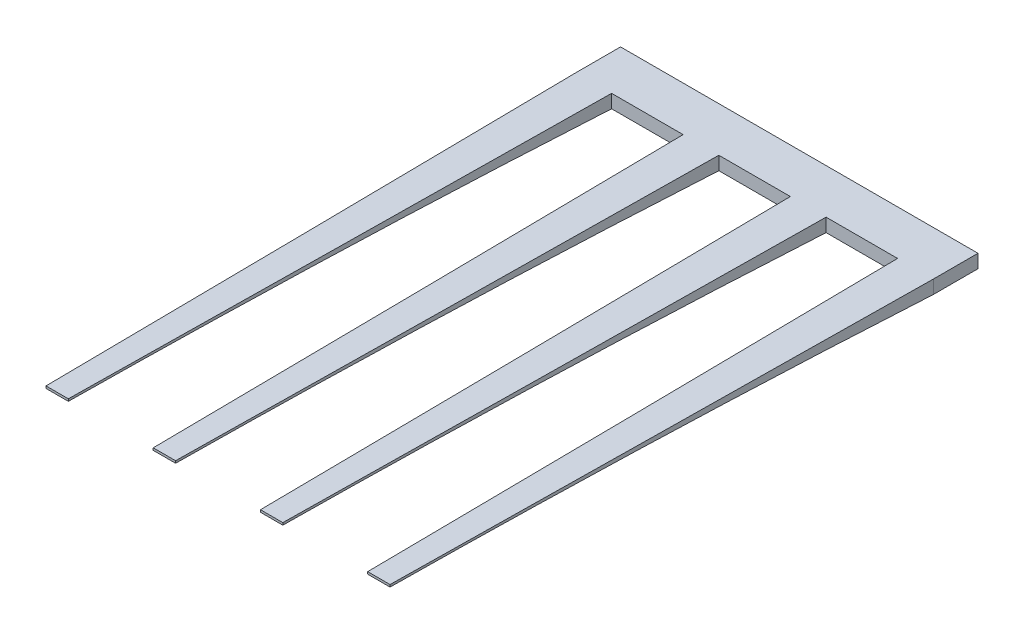
ISO-10303-21;
HEADER;
FILE_DESCRIPTION(('STEP AP214'),'2;1');
FILE_NAME('part.step','',(''),(''),'','','');
FILE_SCHEMA(('AUTOMOTIVE_DESIGN { 1 0 10303 214 1 1 1 1 }'));
ENDSEC;
DATA;
#1=APPLICATION_CONTEXT('core data for automotive mechanical design processes');
#2=APPLICATION_PROTOCOL_DEFINITION('international standard','automotive_design',2000,#1);
#3=PRODUCT_CONTEXT('',#1,'mechanical');
#4=PRODUCT('Part','Part','',(#3));
#5=PRODUCT_RELATED_PRODUCT_CATEGORY('part','',(#4));
#6=PRODUCT_DEFINITION_FORMATION('','',#4);
#7=PRODUCT_DEFINITION_CONTEXT('part definition',#1,'design');
#8=PRODUCT_DEFINITION('design','',#6,#7);
#9=PRODUCT_DEFINITION_SHAPE('','',#8);
#10=(LENGTH_UNIT() NAMED_UNIT(*) SI_UNIT(.MILLI.,.METRE.));
#11=(NAMED_UNIT(*) PLANE_ANGLE_UNIT() SI_UNIT($,.RADIAN.));
#12=(NAMED_UNIT(*) SI_UNIT($,.STERADIAN.) SOLID_ANGLE_UNIT());
#13=UNCERTAINTY_MEASURE_WITH_UNIT(LENGTH_MEASURE(1.E-05),#10,'distance_accuracy_value','');
#14=(GEOMETRIC_REPRESENTATION_CONTEXT(3) GLOBAL_UNCERTAINTY_ASSIGNED_CONTEXT((#13)) GLOBAL_UNIT_ASSIGNED_CONTEXT((#10,
#11,#12)) REPRESENTATION_CONTEXT('',''));
#15=CARTESIAN_POINT('',(0.,0.,0.));
#16=DIRECTION('',(0.,0.,1.));
#17=DIRECTION('',(1.,0.,0.));
#18=AXIS2_PLACEMENT_3D('',#15,#16,#17);
#19=CARTESIAN_POINT('',(0.,0.,200.));
#20=DIRECTION('',(0.,0.,1.));
#21=DIRECTION('',(1.,0.,0.));
#22=AXIS2_PLACEMENT_3D('',#19,#20,#21);
#23=PLANE('',#22);
#24=DIRECTION('',(0.,-1.,0.));
#25=VECTOR('',#24,1.);
#26=CARTESIAN_POINT('',(960.,0.,200.));
#27=LINE('',#26,#25);
#28=CARTESIAN_POINT('',(960.,0.,200.));
#29=VERTEX_POINT('',#28);
#30=CARTESIAN_POINT('',(960.,-60.,200.));
#31=VERTEX_POINT('',#30);
#32=EDGE_CURVE('E316',#29,#31,#27,.T.);
#33=ORIENTED_EDGE('',*,*,#32,.F.);
#34=DIRECTION('',(-1.,0.,0.));
#35=VECTOR('',#34,1.);
#36=CARTESIAN_POINT('',(0.,0.,200.));
#37=LINE('',#36,#35);
#38=CARTESIAN_POINT('',(640.,0.,200.));
#39=VERTEX_POINT('',#38);
#40=EDGE_CURVE('E206',#29,#39,#37,.T.);
#41=ORIENTED_EDGE('',*,*,#40,.T.);
#42=DIRECTION('',(0.,1.,0.));
#43=VECTOR('',#42,1.);
#44=CARTESIAN_POINT('',(640.,0.,200.));
#45=LINE('',#44,#43);
#46=CARTESIAN_POINT('',(640.,-60.,200.));
#47=VERTEX_POINT('',#46);
#48=EDGE_CURVE('E536',#47,#39,#45,.T.);
#49=ORIENTED_EDGE('',*,*,#48,.F.);
#50=DIRECTION('',(1.,0.,0.));
#51=VECTOR('',#50,1.);
#52=CARTESIAN_POINT('',(0.,-60.,200.));
#53=LINE('',#52,#51);
#54=EDGE_CURVE('E525',#47,#31,#53,.T.);
#55=ORIENTED_EDGE('',*,*,#54,.T.);
#56=EDGE_LOOP('',(#33,#41,#49,#55));
#57=FACE_BOUND('',#56,.T.);
#58=ADVANCED_FACE('F67',(#57),#23,.T.);
#59=DIRECTION('',(0.,-1.,0.));
#60=VECTOR('',#59,1.);
#61=CARTESIAN_POINT('',(480.,0.,200.));
#62=LINE('',#61,#60);
#63=CARTESIAN_POINT('',(480.,0.,200.));
#64=VERTEX_POINT('',#63);
#65=CARTESIAN_POINT('',(480.,-60.,200.));
#66=VERTEX_POINT('',#65);
#67=EDGE_CURVE('E704',#64,#66,#62,.T.);
#68=ORIENTED_EDGE('',*,*,#67,.F.);
#69=CARTESIAN_POINT('',(160.,0.,200.));
#70=VERTEX_POINT('',#69);
#71=EDGE_CURVE('E505',#64,#70,#37,.T.);
#72=ORIENTED_EDGE('',*,*,#71,.T.);
#73=DIRECTION('',(0.,1.,0.));
#74=VECTOR('',#73,1.);
#75=CARTESIAN_POINT('',(160.,0.,200.));
#76=LINE('',#75,#74);
#77=CARTESIAN_POINT('',(160.,-60.,200.));
#78=VERTEX_POINT('',#77);
#79=EDGE_CURVE('E766',#78,#70,#76,.T.);
#80=ORIENTED_EDGE('',*,*,#79,.F.);
#81=EDGE_CURVE('E522',#78,#66,#53,.T.);
#82=ORIENTED_EDGE('',*,*,#81,.T.);
#83=EDGE_LOOP('',(#68,#72,#80,#82));
#84=FACE_BOUND('',#83,.T.);
#85=ADVANCED_FACE('F929',(#84),#23,.T.);
#86=DIRECTION('',(0.,-1.,0.));
#87=VECTOR('',#86,1.);
#88=CARTESIAN_POINT('',(1440.,0.,200.));
#89=LINE('',#88,#87);
#90=CARTESIAN_POINT('',(1440.,0.,200.));
#91=VERTEX_POINT('',#90);
#92=CARTESIAN_POINT('',(1440.,-60.,200.));
#93=VERTEX_POINT('',#92);
#94=EDGE_CURVE('E209',#91,#93,#89,.T.);
#95=ORIENTED_EDGE('',*,*,#94,.F.);
#96=CARTESIAN_POINT('',(1120.,0.,200.));
#97=VERTEX_POINT('',#96);
#98=EDGE_CURVE('E197',#91,#97,#37,.T.);
#99=ORIENTED_EDGE('',*,*,#98,.T.);
#100=DIRECTION('',(0.,1.,0.));
#101=VECTOR('',#100,1.);
#102=CARTESIAN_POINT('',(1120.,0.,200.));
#103=LINE('',#102,#101);
#104=CARTESIAN_POINT('',(1120.,-60.,200.));
#105=VERTEX_POINT('',#104);
#106=EDGE_CURVE('E94',#105,#97,#103,.T.);
#107=ORIENTED_EDGE('',*,*,#106,.F.);
#108=EDGE_CURVE('E211',#105,#93,#53,.T.);
#109=ORIENTED_EDGE('',*,*,#108,.T.);
#110=EDGE_LOOP('',(#95,#99,#107,#109));
#111=FACE_BOUND('',#110,.T.);
#112=ADVANCED_FACE('F210',(#111),#23,.T.);
#113=CARTESIAN_POINT('',(0.,0.,200.));
#114=DIRECTION('',(1.,0.,0.));
#115=DIRECTION('',(0.,1.,0.));
#116=AXIS2_PLACEMENT_3D('',#113,#114,#115);
#117=PLANE('',#116);
#118=DIRECTION('',(0.,-1.,0.));
#119=VECTOR('',#118,1.);
#120=CARTESIAN_POINT('',(0.,0.,0.));
#121=LINE('',#120,#119);
#122=CARTESIAN_POINT('',(0.,0.,0.));
#123=VERTEX_POINT('',#122);
#124=CARTESIAN_POINT('',(0.,-60.,0.));
#125=VERTEX_POINT('',#124);
#126=EDGE_CURVE('E512',#123,#125,#121,.T.);
#127=ORIENTED_EDGE('',*,*,#126,.T.);
#128=DIRECTION('',(0.,0.,-1.));
#129=VECTOR('',#128,1.);
#130=CARTESIAN_POINT('',(0.,-60.,200.));
#131=LINE('',#130,#129);
#132=CARTESIAN_POINT('',(0.,-59.9999999999999,200.));
#133=VERTEX_POINT('',#132);
#134=EDGE_CURVE('E12',#133,#125,#131,.T.);
#135=ORIENTED_EDGE('',*,*,#134,.F.);
#136=DIRECTION('',(0.,1.,0.));
#137=VECTOR('',#136,1.);
#138=CARTESIAN_POINT('',(0.,0.,200.));
#139=LINE('',#138,#137);
#140=CARTESIAN_POINT('',(0.,0.,200.));
#141=VERTEX_POINT('',#140);
#142=EDGE_CURVE('E778',#141,#133,#139,.F.);
#143=ORIENTED_EDGE('',*,*,#142,.F.);
#144=DIRECTION('',(0.,0.,-1.));
#145=VECTOR('',#144,1.);
#146=CARTESIAN_POINT('',(0.,0.,200.));
#147=LINE('',#146,#145);
#148=EDGE_CURVE('E205',#141,#123,#147,.T.);
#149=ORIENTED_EDGE('',*,*,#148,.T.);
#150=EDGE_LOOP('',(#127,#135,#143,#149));
#151=FACE_BOUND('',#150,.T.);
#152=ADVANCED_FACE('F69',(#151),#117,.F.);
#153=CARTESIAN_POINT('',(0.,-60.,200.));
#154=DIRECTION('',(0.,1.,0.));
#155=DIRECTION('',(0.,0.,1.));
#156=AXIS2_PLACEMENT_3D('',#153,#154,#155);
#157=PLANE('',#156);
#158=DIRECTION('',(1.,0.,0.));
#159=VECTOR('',#158,1.);
#160=CARTESIAN_POINT('',(0.,-60.,0.));
#161=LINE('',#160,#159);
#162=CARTESIAN_POINT('',(1600.,-60.,0.));
#163=VERTEX_POINT('',#162);
#164=EDGE_CURVE('E790',#125,#163,#161,.T.);
#165=ORIENTED_EDGE('',*,*,#164,.T.);
#166=DIRECTION('',(0.,0.,-1.));
#167=VECTOR('',#166,1.);
#168=CARTESIAN_POINT('',(1600.,-60.,200.));
#169=LINE('',#168,#167);
#170=CARTESIAN_POINT('',(1600.,-60.,200.));
#171=VERTEX_POINT('',#170);
#172=EDGE_CURVE('E78',#171,#163,#169,.T.);
#173=ORIENTED_EDGE('',*,*,#172,.F.);
#174=DIRECTION('',(1.,0.,0.));
#175=VECTOR('',#174,1.);
#176=CARTESIAN_POINT('',(1440.,-60.,200.));
#177=LINE('',#176,#175);
#178=EDGE_CURVE('E86',#93,#171,#177,.T.);
#179=ORIENTED_EDGE('',*,*,#178,.F.);
#180=ORIENTED_EDGE('',*,*,#108,.F.);
#181=DIRECTION('',(1.,0.,0.));
#182=VECTOR('',#181,1.);
#183=CARTESIAN_POINT('',(960.,-60.,200.));
#184=LINE('',#183,#182);
#185=EDGE_CURVE('E405',#31,#105,#184,.T.);
#186=ORIENTED_EDGE('',*,*,#185,.F.);
#187=ORIENTED_EDGE('',*,*,#54,.F.);
#188=DIRECTION('',(1.,0.,0.));
#189=VECTOR('',#188,1.);
#190=CARTESIAN_POINT('',(480.,-60.,200.));
#191=LINE('',#190,#189);
#192=EDGE_CURVE('E532',#66,#47,#191,.T.);
#193=ORIENTED_EDGE('',*,*,#192,.F.);
#194=ORIENTED_EDGE('',*,*,#81,.F.);
#195=DIRECTION('',(1.,0.,0.));
#196=VECTOR('',#195,1.);
#197=CARTESIAN_POINT('',(0.,-60.,200.));
#198=LINE('',#197,#196);
#199=EDGE_CURVE('E520',#133,#78,#198,.T.);
#200=ORIENTED_EDGE('',*,*,#199,.F.);
#201=ORIENTED_EDGE('',*,*,#134,.T.);
#202=EDGE_LOOP('',(#165,#173,#179,#180,#186,#187,#193,#194,#200,#201));
#203=FACE_BOUND('',#202,.T.);
#204=ADVANCED_FACE('F538',(#203),#157,.F.);
#205=CARTESIAN_POINT('',(1600.,0.,200.));
#206=DIRECTION('',(-1.,0.,0.));
#207=DIRECTION('',(0.,0.,1.));
#208=AXIS2_PLACEMENT_3D('',#205,#206,#207);
#209=PLANE('',#208);
#210=DIRECTION('',(0.,1.,0.));
#211=VECTOR('',#210,1.);
#212=CARTESIAN_POINT('',(1600.,0.,0.));
#213=LINE('',#212,#211);
#214=CARTESIAN_POINT('',(1600.,0.,0.));
#215=VERTEX_POINT('',#214);
#216=EDGE_CURVE('E785',#163,#215,#213,.T.);
#217=ORIENTED_EDGE('',*,*,#216,.T.);
#218=DIRECTION('',(0.,0.,-1.));
#219=VECTOR('',#218,1.);
#220=CARTESIAN_POINT('',(1600.,0.,200.));
#221=LINE('',#220,#219);
#222=CARTESIAN_POINT('',(1600.,0.,200.));
#223=VERTEX_POINT('',#222);
#224=EDGE_CURVE('E793',#223,#215,#221,.T.);
#225=ORIENTED_EDGE('',*,*,#224,.F.);
#226=CARTESIAN_POINT('',(1600.,-60.,200.));
#227=CARTESIAN_POINT('',(1600.,-40.,200.));
#228=CARTESIAN_POINT('',(1600.,-20.,200.));
#229=CARTESIAN_POINT('',(1600.,0.,200.));
#230=B_SPLINE_CURVE_WITH_KNOTS('',3,(#226,#227,#228,#229),.UNSPECIFIED.,.F.,.F.,(4,4),(0.,1.),.UNSPECIFIED.);
#231=EDGE_CURVE('E519',#171,#223,#230,.T.);
#232=ORIENTED_EDGE('',*,*,#231,.F.);
#233=ORIENTED_EDGE('',*,*,#172,.T.);
#234=EDGE_LOOP('',(#217,#225,#232,#233));
#235=FACE_BOUND('',#234,.T.);
#236=ADVANCED_FACE('F481',(#235),#209,.F.);
#237=CARTESIAN_POINT('',(0.,0.,200.));
#238=DIRECTION('',(0.,-1.,0.));
#239=DIRECTION('',(0.,0.,-1.));
#240=AXIS2_PLACEMENT_3D('',#237,#238,#239);
#241=PLANE('',#240);
#242=DIRECTION('',(-1.,0.,0.));
#243=VECTOR('',#242,1.);
#244=CARTESIAN_POINT('',(0.,0.,0.));
#245=LINE('',#244,#243);
#246=EDGE_CURVE('E780',#215,#123,#245,.T.);
#247=ORIENTED_EDGE('',*,*,#246,.T.);
#248=ORIENTED_EDGE('',*,*,#148,.F.);
#249=CARTESIAN_POINT('',(0.,0.,200.));
#250=CARTESIAN_POINT('',(5.29543733476208,0.,599.996525271547));
#251=CARTESIAN_POINT('',(15.2933864413457,0.,1399.82214827049));
#252=CARTESIAN_POINT('',(24.1135245263562,0.,2199.99652527155));
#253=CARTESIAN_POINT('',(28.2271307873913,0.,2600.));
#254=B_SPLINE_CURVE_WITH_KNOTS('',3,(#249,#250,#251,#252,#253),.UNSPECIFIED.,.F.,.F.,(4,1,4),
(0.,0.500056664517414,1.),.UNSPECIFIED.);
#255=CARTESIAN_POINT('',(28.2271307873913,0.,2600.));
#256=VERTEX_POINT('',#255);
#257=EDGE_CURVE('E768',#256,#141,#254,.F.);
#258=ORIENTED_EDGE('',*,*,#257,.F.);
#259=DIRECTION('',(-1.,0.,0.));
#260=VECTOR('',#259,1.);
#261=CARTESIAN_POINT('',(28.2271307873913,0.,2600.));
#262=LINE('',#261,#260);
#263=CARTESIAN_POINT('',(128.227130787391,0.,2600.));
#264=VERTEX_POINT('',#263);
#265=EDGE_CURVE('E796',#264,#256,#262,.T.);
#266=ORIENTED_EDGE('',*,*,#265,.F.);
#267=CARTESIAN_POINT('',(160.,0.,200.));
#268=CARTESIAN_POINT('',(155.295426424763,0.,600.003911060482));
#269=CARTESIAN_POINT('',(145.297930512797,0.,1399.81476248136));
#270=CARTESIAN_POINT('',(134.113513616357,0.,2200.00391106048));
#271=CARTESIAN_POINT('',(128.227130787391,0.,2600.));
#272=B_SPLINE_CURVE_WITH_KNOTS('',3,(#267,#268,#269,#270,#271),.UNSPECIFIED.,.F.,.F.,(4,1,4),
(0.,0.500056664517414,1.),.UNSPECIFIED.);
#273=EDGE_CURVE('E798',#70,#264,#272,.T.);
#274=ORIENTED_EDGE('',*,*,#273,.F.);
#275=ORIENTED_EDGE('',*,*,#71,.F.);
#276=CARTESIAN_POINT('',(480.,0.,200.));
#277=CARTESIAN_POINT('',(485.295437334762,0.,599.996525271547));
#278=CARTESIAN_POINT('',(495.293386441346,0.,1399.82214827049));
#279=CARTESIAN_POINT('',(504.113524526356,0.,2199.99652527155));
#280=CARTESIAN_POINT('',(508.227130787391,0.,2600.));
#281=B_SPLINE_CURVE_WITH_KNOTS('',3,(#276,#277,#278,#279,#280),.UNSPECIFIED.,.F.,.F.,(4,1,4),
(0.,0.500056664517414,1.),.UNSPECIFIED.);
#282=CARTESIAN_POINT('',(508.227130787391,0.,2600.));
#283=VERTEX_POINT('',#282);
#284=EDGE_CURVE('E623',#283,#64,#281,.F.);
#285=ORIENTED_EDGE('',*,*,#284,.F.);
#286=DIRECTION('',(-1.,0.,0.));
#287=VECTOR('',#286,1.);
#288=CARTESIAN_POINT('',(508.227130787391,0.,2600.));
#289=LINE('',#288,#287);
#290=CARTESIAN_POINT('',(608.227130787391,0.,2600.));
#291=VERTEX_POINT('',#290);
#292=EDGE_CURVE('E765',#291,#283,#289,.T.);
#293=ORIENTED_EDGE('',*,*,#292,.F.);
#294=CARTESIAN_POINT('',(640.,0.,200.));
#295=CARTESIAN_POINT('',(635.295426424763,0.,600.003911060482));
#296=CARTESIAN_POINT('',(625.297930512797,0.,1399.81476248136));
#297=CARTESIAN_POINT('',(614.113513616357,0.,2200.00391106048));
#298=CARTESIAN_POINT('',(608.227130787391,0.,2600.));
#299=B_SPLINE_CURVE_WITH_KNOTS('',3,(#294,#295,#296,#297,#298),.UNSPECIFIED.,.F.,.F.,(4,1,4),
(0.,0.500056664517414,1.),.UNSPECIFIED.);
#300=EDGE_CURVE('E610',#39,#291,#299,.T.);
#301=ORIENTED_EDGE('',*,*,#300,.F.);
#302=ORIENTED_EDGE('',*,*,#40,.F.);
#303=CARTESIAN_POINT('',(960.,0.,200.));
#304=CARTESIAN_POINT('',(965.295437334762,0.,599.996525271547));
#305=CARTESIAN_POINT('',(975.293386441346,0.,1399.82214827049));
#306=CARTESIAN_POINT('',(984.113524526356,0.,2199.99652527155));
#307=CARTESIAN_POINT('',(988.227130787391,0.,2600.));
#308=B_SPLINE_CURVE_WITH_KNOTS('',3,(#303,#304,#305,#306,#307),.UNSPECIFIED.,.F.,.F.,(4,1,4),
(0.,0.500056664517414,1.),.UNSPECIFIED.);
#309=CARTESIAN_POINT('',(988.227130787391,0.,2600.));
#310=VERTEX_POINT('',#309);
#311=EDGE_CURVE('E377',#310,#29,#308,.F.);
#312=ORIENTED_EDGE('',*,*,#311,.F.);
#313=DIRECTION('',(-1.,0.,0.));
#314=VECTOR('',#313,1.);
#315=CARTESIAN_POINT('',(988.227130787391,0.,2600.));
#316=LINE('',#315,#314);
#317=CARTESIAN_POINT('',(1088.22713078739,0.,2600.));
#318=VERTEX_POINT('',#317);
#319=EDGE_CURVE('E466',#318,#310,#316,.T.);
#320=ORIENTED_EDGE('',*,*,#319,.F.);
#321=CARTESIAN_POINT('',(1120.,0.,200.));
#322=CARTESIAN_POINT('',(1115.29542642476,0.,600.003911060482));
#323=CARTESIAN_POINT('',(1105.2979305128,0.,1399.81476248136));
#324=CARTESIAN_POINT('',(1094.11351361636,0.,2200.00391106048));
#325=CARTESIAN_POINT('',(1088.22713078739,0.,2600.));
#326=B_SPLINE_CURVE_WITH_KNOTS('',3,(#321,#322,#323,#324,#325),.UNSPECIFIED.,.F.,.F.,(4,1,4),
(0.,0.500056664517414,1.),.UNSPECIFIED.);
#327=EDGE_CURVE('E204',#97,#318,#326,.T.);
#328=ORIENTED_EDGE('',*,*,#327,.F.);
#329=ORIENTED_EDGE('',*,*,#98,.F.);
#330=CARTESIAN_POINT('',(1440.,0.,200.));
#331=CARTESIAN_POINT('',(1445.29543733476,0.,599.996525271547));
#332=CARTESIAN_POINT('',(1455.29338644135,0.,1399.82214827049));
#333=CARTESIAN_POINT('',(1464.11352452636,0.,2199.99652527155));
#334=CARTESIAN_POINT('',(1468.22713078739,0.,2600.));
#335=B_SPLINE_CURVE_WITH_KNOTS('',3,(#330,#331,#332,#333,#334),.UNSPECIFIED.,.F.,.F.,(4,1,4),
(0.,0.500056664517414,1.),.UNSPECIFIED.);
#336=CARTESIAN_POINT('',(1468.22713078739,0.,2600.));
#337=VERTEX_POINT('',#336);
#338=EDGE_CURVE('E202',#337,#91,#335,.F.);
#339=ORIENTED_EDGE('',*,*,#338,.F.);
#340=DIRECTION('',(-1.,0.,0.));
#341=VECTOR('',#340,1.);
#342=CARTESIAN_POINT('',(1468.22713078739,0.,2600.));
#343=LINE('',#342,#341);
#344=CARTESIAN_POINT('',(1568.22713078739,0.,2600.));
#345=VERTEX_POINT('',#344);
#346=EDGE_CURVE('E311',#345,#337,#343,.T.);
#347=ORIENTED_EDGE('',*,*,#346,.F.);
#348=CARTESIAN_POINT('',(1600.,0.,200.));
#349=CARTESIAN_POINT('',(1595.29542642476,0.,600.003911060482));
#350=CARTESIAN_POINT('',(1585.2979305128,0.,1399.81476248136));
#351=CARTESIAN_POINT('',(1574.11351361636,0.,2200.00391106048));
#352=CARTESIAN_POINT('',(1568.22713078739,0.,2600.));
#353=B_SPLINE_CURVE_WITH_KNOTS('',3,(#348,#349,#350,#351,#352),.UNSPECIFIED.,.F.,.F.,(4,1,4),
(0.,0.500056664517414,1.),.UNSPECIFIED.);
#354=EDGE_CURVE('E313',#223,#345,#353,.T.);
#355=ORIENTED_EDGE('',*,*,#354,.F.);
#356=ORIENTED_EDGE('',*,*,#224,.T.);
#357=EDGE_LOOP('',(#247,#248,#258,#266,#274,#275,#285,#293,#301,#302,#312,#320,#328,#329,#339,
#347,#355,#356));
#358=FACE_BOUND('',#357,.T.);
#359=ADVANCED_FACE('F199',(#358),#241,.F.);
#360=CARTESIAN_POINT('',(0.,0.,0.));
#361=DIRECTION('',(0.,0.,1.));
#362=DIRECTION('',(1.,0.,0.));
#363=AXIS2_PLACEMENT_3D('',#360,#361,#362);
#364=PLANE('',#363);
#365=ORIENTED_EDGE('',*,*,#126,.F.);
#366=ORIENTED_EDGE('',*,*,#246,.F.);
#367=ORIENTED_EDGE('',*,*,#216,.F.);
#368=ORIENTED_EDGE('',*,*,#164,.F.);
#369=EDGE_LOOP('',(#365,#366,#367,#368));
#370=FACE_BOUND('',#369,.T.);
#371=ADVANCED_FACE('F480',(#370),#364,.F.);
#372=CARTESIAN_POINT('',(0.,0.,2600.));
#373=DIRECTION('',(0.,0.,1.));
#374=DIRECTION('',(1.,0.,0.));
#375=AXIS2_PLACEMENT_3D('',#372,#373,#374);
#376=PLANE('',#375);
#377=DIRECTION('',(0.,-1.,0.));
#378=VECTOR('',#377,1.);
#379=CARTESIAN_POINT('',(28.2271307873913,0.,2600.));
#380=LINE('',#379,#378);
#381=CARTESIAN_POINT('',(28.2271307873913,-10.,2600.));
#382=VERTEX_POINT('',#381);
#383=EDGE_CURVE('E849',#256,#382,#380,.T.);
#384=ORIENTED_EDGE('',*,*,#383,.T.);
#385=DIRECTION('',(1.,0.,0.));
#386=VECTOR('',#385,1.);
#387=CARTESIAN_POINT('',(28.2271307873913,-10.,2600.));
#388=LINE('',#387,#386);
#389=CARTESIAN_POINT('',(128.227130787391,-10.,2600.));
#390=VERTEX_POINT('',#389);
#391=EDGE_CURVE('E808',#382,#390,#388,.T.);
#392=ORIENTED_EDGE('',*,*,#391,.T.);
#393=DIRECTION('',(0.,1.,0.));
#394=VECTOR('',#393,1.);
#395=CARTESIAN_POINT('',(128.227130787391,0.,2600.));
#396=LINE('',#395,#394);
#397=EDGE_CURVE('E803',#390,#264,#396,.T.);
#398=ORIENTED_EDGE('',*,*,#397,.T.);
#399=ORIENTED_EDGE('',*,*,#265,.T.);
#400=EDGE_LOOP('',(#384,#392,#398,#399));
#401=FACE_BOUND('',#400,.T.);
#402=ADVANCED_FACE('F807',(#401),#376,.T.);
#403=CARTESIAN_POINT('',(0.,0.,200.));
#404=CARTESIAN_POINT('',(5.29543733476208,0.,599.996525271547));
#405=CARTESIAN_POINT('',(15.2933864413457,0.,1399.82214827049));
#406=CARTESIAN_POINT('',(24.1135245263562,0.,2199.99652527155));
#407=CARTESIAN_POINT('',(28.2271307873913,0.,2600.));
#408=CARTESIAN_POINT('',(0.,-20.,200.));
#409=CARTESIAN_POINT('',(5.29502919564721,-13.8896359743162,599.961823413853));
#410=CARTESIAN_POINT('',(15.293794580471,-5.00051208325618,1399.85685012907));
#411=CARTESIAN_POINT('',(24.1131163872414,-2.77852486320511,2199.96182341385));
#412=CARTESIAN_POINT('',(28.2271307873913,-3.33333333333333,2600.));
#413=CARTESIAN_POINT('',(0.,-40.,200.));
#414=CARTESIAN_POINT('',(5.29462105653233,-27.7792719486324,599.927121556159));
#415=CARTESIAN_POINT('',(15.2942027195964,-10.0010241665124,1399.89155198766));
#416=CARTESIAN_POINT('',(24.1127082481265,-5.55704972641022,2199.92712155616));
#417=CARTESIAN_POINT('',(28.2271307873913,-6.66666666666667,2600.));
#418=CARTESIAN_POINT('',(0.,-60.,200.));
#419=CARTESIAN_POINT('',(5.29421291741746,-41.6689079229487,599.892419698464));
#420=CARTESIAN_POINT('',(15.2946108587217,-15.0015362497685,1399.92625384624));
#421=CARTESIAN_POINT('',(24.1123001090116,-8.33557458961532,2199.89241969846));
#422=CARTESIAN_POINT('',(28.2271307873913,-10.,2600.));
#423=B_SPLINE_SURFACE_WITH_KNOTS('',3,3,((#403,#404,#405,#406,#407),(#408,#409,#410,#411,#412),
(#413,#414,#415,#416,#417),(#418,#419,#420,#421,#422)),.UNSPECIFIED.,.F.,.F.,.F.,(4,4),(4,1,4),
(0.,1.),(0.,0.500056664517414,1.),.UNSPECIFIED.);
#424=CARTESIAN_POINT('',(0.,-60.,200.));
#425=CARTESIAN_POINT('',(5.29421291741746,-41.6689079229487,599.892419698464));
#426=CARTESIAN_POINT('',(15.2946108587217,-15.0015362497685,1399.92625384624));
#427=CARTESIAN_POINT('',(24.1123001090116,-8.33557458961532,2199.89241969846));
#428=CARTESIAN_POINT('',(28.2271307873913,-10.,2600.));
#429=B_SPLINE_CURVE_WITH_KNOTS('',3,(#424,#425,#426,#427,#428),.UNSPECIFIED.,.F.,.F.,(4,1,4),
(0.,0.500056664517414,1.),.UNSPECIFIED.);
#430=EDGE_CURVE('E776',#133,#382,#429,.T.);
#431=ORIENTED_EDGE('',*,*,#142,.T.);
#432=ORIENTED_EDGE('',*,*,#430,.T.);
#433=ORIENTED_EDGE('',*,*,#383,.F.);
#434=ORIENTED_EDGE('',*,*,#257,.T.);
#435=EDGE_LOOP('',(#431,#432,#433,#434));
#436=FACE_BOUND('',#435,.T.);
#437=ADVANCED_FACE('F742',(#436),#423,.T.);
#438=CARTESIAN_POINT('',(0.,-60.,200.));
#439=CARTESIAN_POINT('',(5.29421291741746,-41.6689079229487,599.892419698464));
#440=CARTESIAN_POINT('',(15.2946108587217,-15.0015362497685,1399.92625384624));
#441=CARTESIAN_POINT('',(24.1123001090116,-8.33557458961532,2199.89241969846));
#442=CARTESIAN_POINT('',(28.2271307873913,-10.,2600.));
#443=CARTESIAN_POINT('',(53.3333333333333,-60.,200.));
#444=CARTESIAN_POINT('',(55.2950768243731,-41.6688566283096,599.894881841139));
#445=CARTESIAN_POINT('',(58.6285913388944,-15.0015875444089,1399.92379170351));
#446=CARTESIAN_POINT('',(60.7798306826339,-8.33552329497627,2199.89488184114));
#447=CARTESIAN_POINT('',(61.5604641207246,-10.,2600.));
#448=CARTESIAN_POINT('',(106.666666666667,-60.,200.));
#449=CARTESIAN_POINT('',(105.295940731329,-41.6688053336705,599.897343983814));
#450=CARTESIAN_POINT('',(101.962571819067,-15.0016388390493,1399.92132956077));
#451=CARTESIAN_POINT('',(97.4473612562562,-8.33547200033721,2199.89734398381));
#452=CARTESIAN_POINT('',(94.8937974540579,-10.,2600.));
#453=CARTESIAN_POINT('',(160.,-60.,200.));
#454=CARTESIAN_POINT('',(155.296804638284,-41.6687540390315,599.899806126488));
#455=CARTESIAN_POINT('',(145.29655229924,-15.0016901336897,1399.91886741803));
#456=CARTESIAN_POINT('',(134.114891829879,-8.33542070569816,2199.89980612649));
#457=CARTESIAN_POINT('',(128.227130787391,-10.,2600.));
#458=B_SPLINE_SURFACE_WITH_KNOTS('',3,3,((#438,#439,#440,#441,#442),(#443,#444,#445,#446,#447),
(#448,#449,#450,#451,#452),(#453,#454,#455,#456,#457)),.UNSPECIFIED.,.F.,.F.,.F.,(4,4),(4,1,4),
(0.,1.),(0.,0.500056664517414,1.),.UNSPECIFIED.);
#459=CARTESIAN_POINT('',(160.,-60.,200.));
#460=CARTESIAN_POINT('',(155.296804638284,-41.6687540390315,599.899806126488));
#461=CARTESIAN_POINT('',(145.29655229924,-15.0016901336897,1399.91886741803));
#462=CARTESIAN_POINT('',(134.114891829879,-8.33542070569816,2199.89980612649));
#463=CARTESIAN_POINT('',(128.227130787391,-10.,2600.));
#464=B_SPLINE_CURVE_WITH_KNOTS('',3,(#459,#460,#461,#462,#463),.UNSPECIFIED.,.F.,.F.,(4,1,4),
(0.,0.500056664517414,1.),.UNSPECIFIED.);
#465=EDGE_CURVE('E859',#78,#390,#464,.T.);
#466=ORIENTED_EDGE('',*,*,#199,.T.);
#467=ORIENTED_EDGE('',*,*,#465,.T.);
#468=ORIENTED_EDGE('',*,*,#391,.F.);
#469=ORIENTED_EDGE('',*,*,#430,.F.);
#470=EDGE_LOOP('',(#466,#467,#468,#469));
#471=FACE_BOUND('',#470,.T.);
#472=ADVANCED_FACE('F908',(#471),#458,.T.);
#473=CARTESIAN_POINT('',(160.,-60.,200.));
#474=CARTESIAN_POINT('',(155.296804638284,-41.6687540390315,599.899806126488));
#475=CARTESIAN_POINT('',(145.29655229924,-15.0016901336897,1399.91886741803));
#476=CARTESIAN_POINT('',(134.114891829879,-8.33542070569816,2199.89980612649));
#477=CARTESIAN_POINT('',(128.227130787391,-10.,2600.));
#478=CARTESIAN_POINT('',(160.,-40.,200.));
#479=CARTESIAN_POINT('',(155.296345233777,-27.7791693593543,599.934507771153));
#480=CARTESIAN_POINT('',(145.297011703759,-10.0011267557931,1399.88416577247));
#481=CARTESIAN_POINT('',(134.114432425371,-5.5569471371321,2199.93450777115));
#482=CARTESIAN_POINT('',(128.227130787391,-6.66666666666667,2600.));
#483=CARTESIAN_POINT('',(160.,-20.,200.));
#484=CARTESIAN_POINT('',(155.29588582927,-13.8895846796772,599.969209415817));
#485=CARTESIAN_POINT('',(145.297471108278,-5.00056337789655,1399.84946412692));
#486=CARTESIAN_POINT('',(134.113973020864,-2.77847356856605,2199.96920941582));
#487=CARTESIAN_POINT('',(128.227130787391,-3.33333333333333,2600.));
#488=CARTESIAN_POINT('',(160.,0.,200.));
#489=CARTESIAN_POINT('',(155.295426424763,0.,600.003911060482));
#490=CARTESIAN_POINT('',(145.297930512797,0.,1399.81476248136));
#491=CARTESIAN_POINT('',(134.113513616357,0.,2200.00391106048));
#492=CARTESIAN_POINT('',(128.227130787391,0.,2600.));
#493=B_SPLINE_SURFACE_WITH_KNOTS('',3,3,((#473,#474,#475,#476,#477),(#478,#479,#480,#481,#482),
(#483,#484,#485,#486,#487),(#488,#489,#490,#491,#492)),.UNSPECIFIED.,.F.,.F.,.F.,(4,4),(4,1,4),
(0.,1.),(0.,0.500056664517414,1.),.UNSPECIFIED.);
#494=ORIENTED_EDGE('',*,*,#79,.T.);
#495=ORIENTED_EDGE('',*,*,#273,.T.);
#496=ORIENTED_EDGE('',*,*,#397,.F.);
#497=ORIENTED_EDGE('',*,*,#465,.F.);
#498=EDGE_LOOP('',(#494,#495,#496,#497));
#499=FACE_BOUND('',#498,.T.);
#500=ADVANCED_FACE('F741',(#499),#493,.T.);
#501=CARTESIAN_POINT('',(480.,0.,2600.));
#502=DIRECTION('',(0.,0.,1.));
#503=DIRECTION('',(1.,0.,0.));
#504=AXIS2_PLACEMENT_3D('',#501,#502,#503);
#505=PLANE('',#504);
#506=DIRECTION('',(0.,-1.,0.));
#507=VECTOR('',#506,1.);
#508=CARTESIAN_POINT('',(508.227130787391,0.,2600.));
#509=LINE('',#508,#507);
#510=CARTESIAN_POINT('',(508.227130787391,-10.,2600.));
#511=VERTEX_POINT('',#510);
#512=EDGE_CURVE('E617',#283,#511,#509,.T.);
#513=ORIENTED_EDGE('',*,*,#512,.T.);
#514=DIRECTION('',(1.,0.,0.));
#515=VECTOR('',#514,1.);
#516=CARTESIAN_POINT('',(508.227130787391,-10.,2600.));
#517=LINE('',#516,#515);
#518=CARTESIAN_POINT('',(608.227130787391,-10.,2600.));
#519=VERTEX_POINT('',#518);
#520=EDGE_CURVE('E718',#511,#519,#517,.T.);
#521=ORIENTED_EDGE('',*,*,#520,.T.);
#522=DIRECTION('',(0.,1.,0.));
#523=VECTOR('',#522,1.);
#524=CARTESIAN_POINT('',(608.227130787391,0.,2600.));
#525=LINE('',#524,#523);
#526=EDGE_CURVE('E690',#519,#291,#525,.T.);
#527=ORIENTED_EDGE('',*,*,#526,.T.);
#528=ORIENTED_EDGE('',*,*,#292,.T.);
#529=EDGE_LOOP('',(#513,#521,#527,#528));
#530=FACE_BOUND('',#529,.T.);
#531=ADVANCED_FACE('F722',(#530),#505,.T.);
#532=CARTESIAN_POINT('',(480.,0.,200.));
#533=CARTESIAN_POINT('',(485.295437334762,0.,599.996525271547));
#534=CARTESIAN_POINT('',(495.293386441346,0.,1399.82214827049));
#535=CARTESIAN_POINT('',(504.113524526356,0.,2199.99652527155));
#536=CARTESIAN_POINT('',(508.227130787391,0.,2600.));
#537=CARTESIAN_POINT('',(480.,-20.,200.));
#538=CARTESIAN_POINT('',(485.295029195647,-13.8896359743162,599.961823413853));
#539=CARTESIAN_POINT('',(495.293794580471,-5.00051208325618,1399.85685012907));
#540=CARTESIAN_POINT('',(504.113116387241,-2.77852486320511,2199.96182341385));
#541=CARTESIAN_POINT('',(508.227130787391,-3.33333333333333,2600.));
#542=CARTESIAN_POINT('',(480.,-40.,200.));
#543=CARTESIAN_POINT('',(485.294621056532,-27.7792719486324,599.927121556159));
#544=CARTESIAN_POINT('',(495.294202719596,-10.0010241665124,1399.89155198766));
#545=CARTESIAN_POINT('',(504.112708248126,-5.55704972641022,2199.92712155616));
#546=CARTESIAN_POINT('',(508.227130787391,-6.66666666666667,2600.));
#547=CARTESIAN_POINT('',(480.,-60.,200.));
#548=CARTESIAN_POINT('',(485.294212917417,-41.6689079229487,599.892419698464));
#549=CARTESIAN_POINT('',(495.294610858722,-15.0015362497685,1399.92625384624));
#550=CARTESIAN_POINT('',(504.112300109012,-8.33557458961532,2199.89241969846));
#551=CARTESIAN_POINT('',(508.227130787391,-10.,2600.));
#552=B_SPLINE_SURFACE_WITH_KNOTS('',3,3,((#532,#533,#534,#535,#536),(#537,#538,#539,#540,#541),
(#542,#543,#544,#545,#546),(#547,#548,#549,#550,#551)),.UNSPECIFIED.,.F.,.F.,.F.,(4,4),(4,1,4),
(0.,1.),(0.,0.500056664517414,1.),.UNSPECIFIED.);
#553=CARTESIAN_POINT('',(480.,-60.,200.));
#554=CARTESIAN_POINT('',(485.294212917417,-41.6689079229487,599.892419698464));
#555=CARTESIAN_POINT('',(495.294610858722,-15.0015362497685,1399.92625384624));
#556=CARTESIAN_POINT('',(504.112300109012,-8.33557458961532,2199.89241969846));
#557=CARTESIAN_POINT('',(508.227130787391,-10.,2600.));
#558=B_SPLINE_CURVE_WITH_KNOTS('',3,(#553,#554,#555,#556,#557),.UNSPECIFIED.,.F.,.F.,(4,1,4),
(0.,0.500056664517414,1.),.UNSPECIFIED.);
#559=EDGE_CURVE('E629',#66,#511,#558,.T.);
#560=ORIENTED_EDGE('',*,*,#67,.T.);
#561=ORIENTED_EDGE('',*,*,#559,.T.);
#562=ORIENTED_EDGE('',*,*,#512,.F.);
#563=ORIENTED_EDGE('',*,*,#284,.T.);
#564=EDGE_LOOP('',(#560,#561,#562,#563));
#565=FACE_BOUND('',#564,.T.);
#566=ADVANCED_FACE('F595',(#565),#552,.T.);
#567=CARTESIAN_POINT('',(480.,-60.,200.));
#568=CARTESIAN_POINT('',(485.294212917417,-41.6689079229487,599.892419698464));
#569=CARTESIAN_POINT('',(495.294610858722,-15.0015362497685,1399.92625384624));
#570=CARTESIAN_POINT('',(504.112300109012,-8.33557458961532,2199.89241969846));
#571=CARTESIAN_POINT('',(508.227130787391,-10.,2600.));
#572=CARTESIAN_POINT('',(533.333333333333,-60.,200.));
#573=CARTESIAN_POINT('',(535.295076824373,-41.6688566283096,599.894881841139));
#574=CARTESIAN_POINT('',(538.628591338894,-15.0015875444089,1399.92379170351));
#575=CARTESIAN_POINT('',(540.779830682634,-8.33552329497627,2199.89488184114));
#576=CARTESIAN_POINT('',(541.560464120725,-10.,2600.));
#577=CARTESIAN_POINT('',(586.666666666667,-60.,200.));
#578=CARTESIAN_POINT('',(585.295940731329,-41.6688053336705,599.897343983814));
#579=CARTESIAN_POINT('',(581.962571819067,-15.0016388390493,1399.92132956077));
#580=CARTESIAN_POINT('',(577.447361256256,-8.33547200033721,2199.89734398381));
#581=CARTESIAN_POINT('',(574.893797454058,-10.,2600.));
#582=CARTESIAN_POINT('',(640.,-60.,200.));
#583=CARTESIAN_POINT('',(635.296804638284,-41.6687540390315,599.899806126488));
#584=CARTESIAN_POINT('',(625.29655229924,-15.0016901336897,1399.91886741803));
#585=CARTESIAN_POINT('',(614.114891829879,-8.33542070569816,2199.89980612649));
#586=CARTESIAN_POINT('',(608.227130787391,-10.,2600.));
#587=B_SPLINE_SURFACE_WITH_KNOTS('',3,3,((#567,#568,#569,#570,#571),(#572,#573,#574,#575,#576),
(#577,#578,#579,#580,#581),(#582,#583,#584,#585,#586)),.UNSPECIFIED.,.F.,.F.,.F.,(4,4),(4,1,4),
(0.,1.),(0.,0.500056664517414,1.),.UNSPECIFIED.);
#588=CARTESIAN_POINT('',(640.,-60.,200.));
#589=CARTESIAN_POINT('',(635.296804638284,-41.6687540390315,599.899806126488));
#590=CARTESIAN_POINT('',(625.29655229924,-15.0016901336897,1399.91886741803));
#591=CARTESIAN_POINT('',(614.114891829879,-8.33542070569816,2199.89980612649));
#592=CARTESIAN_POINT('',(608.227130787391,-10.,2600.));
#593=B_SPLINE_CURVE_WITH_KNOTS('',3,(#588,#589,#590,#591,#592),.UNSPECIFIED.,.F.,.F.,(4,1,4),
(0.,0.500056664517414,1.),.UNSPECIFIED.);
#594=EDGE_CURVE('E618',#47,#519,#593,.T.);
#595=ORIENTED_EDGE('',*,*,#192,.T.);
#596=ORIENTED_EDGE('',*,*,#594,.T.);
#597=ORIENTED_EDGE('',*,*,#520,.F.);
#598=ORIENTED_EDGE('',*,*,#559,.F.);
#599=EDGE_LOOP('',(#595,#596,#597,#598));
#600=FACE_BOUND('',#599,.T.);
#601=ADVANCED_FACE('F655',(#600),#587,.T.);
#602=CARTESIAN_POINT('',(640.,-60.,200.));
#603=CARTESIAN_POINT('',(635.296804638284,-41.6687540390315,599.899806126488));
#604=CARTESIAN_POINT('',(625.29655229924,-15.0016901336897,1399.91886741803));
#605=CARTESIAN_POINT('',(614.114891829879,-8.33542070569816,2199.89980612649));
#606=CARTESIAN_POINT('',(608.227130787391,-10.,2600.));
#607=CARTESIAN_POINT('',(640.,-40.,200.));
#608=CARTESIAN_POINT('',(635.296345233777,-27.7791693593543,599.934507771153));
#609=CARTESIAN_POINT('',(625.297011703759,-10.0011267557931,1399.88416577247));
#610=CARTESIAN_POINT('',(614.114432425371,-5.5569471371321,2199.93450777115));
#611=CARTESIAN_POINT('',(608.227130787391,-6.66666666666667,2600.));
#612=CARTESIAN_POINT('',(640.,-20.,200.));
#613=CARTESIAN_POINT('',(635.29588582927,-13.8895846796772,599.969209415817));
#614=CARTESIAN_POINT('',(625.297471108278,-5.00056337789655,1399.84946412692));
#615=CARTESIAN_POINT('',(614.113973020864,-2.77847356856605,2199.96920941582));
#616=CARTESIAN_POINT('',(608.227130787391,-3.33333333333333,2600.));
#617=CARTESIAN_POINT('',(640.,0.,200.));
#618=CARTESIAN_POINT('',(635.295426424763,0.,600.003911060482));
#619=CARTESIAN_POINT('',(625.297930512797,0.,1399.81476248136));
#620=CARTESIAN_POINT('',(614.113513616357,0.,2200.00391106048));
#621=CARTESIAN_POINT('',(608.227130787391,0.,2600.));
#622=B_SPLINE_SURFACE_WITH_KNOTS('',3,3,((#602,#603,#604,#605,#606),(#607,#608,#609,#610,#611),
(#612,#613,#614,#615,#616),(#617,#618,#619,#620,#621)),.UNSPECIFIED.,.F.,.F.,.F.,(4,4),(4,1,4),
(0.,1.),(0.,0.500056664517414,1.),.UNSPECIFIED.);
#623=ORIENTED_EDGE('',*,*,#48,.T.);
#624=ORIENTED_EDGE('',*,*,#300,.T.);
#625=ORIENTED_EDGE('',*,*,#526,.F.);
#626=ORIENTED_EDGE('',*,*,#594,.F.);
#627=EDGE_LOOP('',(#623,#624,#625,#626));
#628=FACE_BOUND('',#627,.T.);
#629=ADVANCED_FACE('F594',(#628),#622,.T.);
#630=CARTESIAN_POINT('',(960.,0.,2600.));
#631=DIRECTION('',(0.,0.,1.));
#632=DIRECTION('',(1.,0.,0.));
#633=AXIS2_PLACEMENT_3D('',#630,#631,#632);
#634=PLANE('',#633);
#635=DIRECTION('',(0.,-1.,0.));
#636=VECTOR('',#635,1.);
#637=CARTESIAN_POINT('',(988.227130787391,0.,2600.));
#638=LINE('',#637,#636);
#639=CARTESIAN_POINT('',(988.227130787391,-10.,2600.));
#640=VERTEX_POINT('',#639);
#641=EDGE_CURVE('E371',#310,#640,#638,.T.);
#642=ORIENTED_EDGE('',*,*,#641,.T.);
#643=DIRECTION('',(1.,0.,0.));
#644=VECTOR('',#643,1.);
#645=CARTESIAN_POINT('',(988.227130787391,-10.,2600.));
#646=LINE('',#645,#644);
#647=CARTESIAN_POINT('',(1088.22713078739,-10.,2600.));
#648=VERTEX_POINT('',#647);
#649=EDGE_CURVE('E567',#640,#648,#646,.T.);
#650=ORIENTED_EDGE('',*,*,#649,.T.);
#651=DIRECTION('',(0.,1.,0.));
#652=VECTOR('',#651,1.);
#653=CARTESIAN_POINT('',(1088.22713078739,0.,2600.));
#654=LINE('',#653,#652);
#655=EDGE_CURVE('E446',#648,#318,#654,.T.);
#656=ORIENTED_EDGE('',*,*,#655,.T.);
#657=ORIENTED_EDGE('',*,*,#319,.T.);
#658=EDGE_LOOP('',(#642,#650,#656,#657));
#659=FACE_BOUND('',#658,.T.);
#660=ADVANCED_FACE('F585',(#659),#634,.T.);
#661=CARTESIAN_POINT('',(960.,0.,200.));
#662=CARTESIAN_POINT('',(965.295437334762,0.,599.996525271547));
#663=CARTESIAN_POINT('',(975.293386441346,0.,1399.82214827049));
#664=CARTESIAN_POINT('',(984.113524526356,0.,2199.99652527155));
#665=CARTESIAN_POINT('',(988.227130787391,0.,2600.));
#666=CARTESIAN_POINT('',(960.,-20.,200.));
#667=CARTESIAN_POINT('',(965.295029195647,-13.8896359743162,599.961823413853));
#668=CARTESIAN_POINT('',(975.293794580471,-5.00051208325618,1399.85685012907));
#669=CARTESIAN_POINT('',(984.113116387241,-2.77852486320511,2199.96182341385));
#670=CARTESIAN_POINT('',(988.227130787391,-3.33333333333333,2600.));
#671=CARTESIAN_POINT('',(960.,-40.,200.));
#672=CARTESIAN_POINT('',(965.294621056532,-27.7792719486324,599.927121556159));
#673=CARTESIAN_POINT('',(975.294202719596,-10.0010241665124,1399.89155198766));
#674=CARTESIAN_POINT('',(984.112708248126,-5.55704972641022,2199.92712155616));
#675=CARTESIAN_POINT('',(988.227130787391,-6.66666666666667,2600.));
#676=CARTESIAN_POINT('',(960.,-60.,200.));
#677=CARTESIAN_POINT('',(965.294212917417,-41.6689079229487,599.892419698464));
#678=CARTESIAN_POINT('',(975.294610858722,-15.0015362497685,1399.92625384624));
#679=CARTESIAN_POINT('',(984.112300109012,-8.33557458961532,2199.89241969846));
#680=CARTESIAN_POINT('',(988.227130787391,-10.,2600.));
#681=B_SPLINE_SURFACE_WITH_KNOTS('',3,3,((#661,#662,#663,#664,#665),(#666,#667,#668,#669,#670),
(#671,#672,#673,#674,#675),(#676,#677,#678,#679,#680)),.UNSPECIFIED.,.F.,.F.,.F.,(4,4),(4,1,4),
(0.,1.),(0.,0.500056664517414,1.),.UNSPECIFIED.);
#682=CARTESIAN_POINT('',(960.,-60.,200.));
#683=CARTESIAN_POINT('',(965.294212917417,-41.6689079229487,599.892419698464));
#684=CARTESIAN_POINT('',(975.294610858722,-15.0015362497685,1399.92625384624));
#685=CARTESIAN_POINT('',(984.112300109012,-8.33557458961532,2199.89241969846));
#686=CARTESIAN_POINT('',(988.227130787391,-10.,2600.));
#687=B_SPLINE_CURVE_WITH_KNOTS('',3,(#682,#683,#684,#685,#686),.UNSPECIFIED.,.F.,.F.,(4,1,4),
(0.,0.500056664517414,1.),.UNSPECIFIED.);
#688=EDGE_CURVE('E383',#31,#640,#687,.T.);
#689=ORIENTED_EDGE('',*,*,#32,.T.);
#690=ORIENTED_EDGE('',*,*,#688,.T.);
#691=ORIENTED_EDGE('',*,*,#641,.F.);
#692=ORIENTED_EDGE('',*,*,#311,.T.);
#693=EDGE_LOOP('',(#689,#690,#691,#692));
#694=FACE_BOUND('',#693,.T.);
#695=ADVANCED_FACE('F338',(#694),#681,.T.);
#696=CARTESIAN_POINT('',(960.,-60.,200.));
#697=CARTESIAN_POINT('',(965.294212917417,-41.6689079229487,599.892419698464));
#698=CARTESIAN_POINT('',(975.294610858722,-15.0015362497685,1399.92625384624));
#699=CARTESIAN_POINT('',(984.112300109012,-8.33557458961532,2199.89241969846));
#700=CARTESIAN_POINT('',(988.227130787391,-10.,2600.));
#701=CARTESIAN_POINT('',(1013.33333333333,-60.,200.));
#702=CARTESIAN_POINT('',(1015.29507682437,-41.6688566283096,599.894881841139));
#703=CARTESIAN_POINT('',(1018.62859133889,-15.0015875444089,1399.92379170351));
#704=CARTESIAN_POINT('',(1020.77983068263,-8.33552329497627,2199.89488184114));
#705=CARTESIAN_POINT('',(1021.56046412072,-10.,2600.));
#706=CARTESIAN_POINT('',(1066.66666666667,-60.,200.));
#707=CARTESIAN_POINT('',(1065.29594073133,-41.6688053336705,599.897343983814));
#708=CARTESIAN_POINT('',(1061.96257181907,-15.0016388390493,1399.92132956077));
#709=CARTESIAN_POINT('',(1057.44736125626,-8.33547200033721,2199.89734398381));
#710=CARTESIAN_POINT('',(1054.89379745406,-10.,2600.));
#711=CARTESIAN_POINT('',(1120.,-60.,200.));
#712=CARTESIAN_POINT('',(1115.29680463828,-41.6687540390315,599.899806126488));
#713=CARTESIAN_POINT('',(1105.29655229924,-15.0016901336897,1399.91886741803));
#714=CARTESIAN_POINT('',(1094.11489182988,-8.33542070569816,2199.89980612649));
#715=CARTESIAN_POINT('',(1088.22713078739,-10.,2600.));
#716=B_SPLINE_SURFACE_WITH_KNOTS('',3,3,((#696,#697,#698,#699,#700),(#701,#702,#703,#704,#705),
(#706,#707,#708,#709,#710),(#711,#712,#713,#714,#715)),.UNSPECIFIED.,.F.,.F.,.F.,(4,4),(4,1,4),
(0.,1.),(0.,0.500056664517414,1.),.UNSPECIFIED.);
#717=CARTESIAN_POINT('',(1120.,-60.,200.));
#718=CARTESIAN_POINT('',(1115.29680463828,-41.6687540390315,599.899806126488));
#719=CARTESIAN_POINT('',(1105.29655229924,-15.0016901336897,1399.91886741803));
#720=CARTESIAN_POINT('',(1094.11489182988,-8.33542070569816,2199.89980612649));
#721=CARTESIAN_POINT('',(1088.22713078739,-10.,2600.));
#722=B_SPLINE_CURVE_WITH_KNOTS('',3,(#717,#718,#719,#720,#721),.UNSPECIFIED.,.F.,.F.,(4,1,4),
(0.,0.500056664517414,1.),.UNSPECIFIED.);
#723=EDGE_CURVE('E372',#105,#648,#722,.T.);
#724=ORIENTED_EDGE('',*,*,#185,.T.);
#725=ORIENTED_EDGE('',*,*,#723,.T.);
#726=ORIENTED_EDGE('',*,*,#649,.F.);
#727=ORIENTED_EDGE('',*,*,#688,.F.);
#728=EDGE_LOOP('',(#724,#725,#726,#727));
#729=FACE_BOUND('',#728,.T.);
#730=ADVANCED_FACE('F411',(#729),#716,.T.);
#731=CARTESIAN_POINT('',(1120.,-60.,200.));
#732=CARTESIAN_POINT('',(1115.29680463828,-41.6687540390315,599.899806126488));
#733=CARTESIAN_POINT('',(1105.29655229924,-15.0016901336897,1399.91886741803));
#734=CARTESIAN_POINT('',(1094.11489182988,-8.33542070569816,2199.89980612649));
#735=CARTESIAN_POINT('',(1088.22713078739,-10.,2600.));
#736=CARTESIAN_POINT('',(1120.,-40.,200.));
#737=CARTESIAN_POINT('',(1115.29634523378,-27.7791693593543,599.934507771153));
#738=CARTESIAN_POINT('',(1105.29701170376,-10.0011267557931,1399.88416577247));
#739=CARTESIAN_POINT('',(1094.11443242537,-5.5569471371321,2199.93450777115));
#740=CARTESIAN_POINT('',(1088.22713078739,-6.66666666666667,2600.));
#741=CARTESIAN_POINT('',(1120.,-20.,200.));
#742=CARTESIAN_POINT('',(1115.29588582927,-13.8895846796772,599.969209415817));
#743=CARTESIAN_POINT('',(1105.29747110828,-5.00056337789655,1399.84946412692));
#744=CARTESIAN_POINT('',(1094.11397302086,-2.77847356856605,2199.96920941582));
#745=CARTESIAN_POINT('',(1088.22713078739,-3.33333333333333,2600.));
#746=CARTESIAN_POINT('',(1120.,0.,200.));
#747=CARTESIAN_POINT('',(1115.29542642476,0.,600.003911060482));
#748=CARTESIAN_POINT('',(1105.2979305128,0.,1399.81476248136));
#749=CARTESIAN_POINT('',(1094.11351361636,0.,2200.00391106048));
#750=CARTESIAN_POINT('',(1088.22713078739,0.,2600.));
#751=B_SPLINE_SURFACE_WITH_KNOTS('',3,3,((#731,#732,#733,#734,#735),(#736,#737,#738,#739,#740),
(#741,#742,#743,#744,#745),(#746,#747,#748,#749,#750)),.UNSPECIFIED.,.F.,.F.,.F.,(4,4),(4,1,4),
(0.,1.),(0.,0.500056664517414,1.),.UNSPECIFIED.);
#752=ORIENTED_EDGE('',*,*,#106,.T.);
#753=ORIENTED_EDGE('',*,*,#327,.T.);
#754=ORIENTED_EDGE('',*,*,#655,.F.);
#755=ORIENTED_EDGE('',*,*,#723,.F.);
#756=EDGE_LOOP('',(#752,#753,#754,#755));
#757=FACE_BOUND('',#756,.T.);
#758=ADVANCED_FACE('F337',(#757),#751,.T.);
#759=CARTESIAN_POINT('',(1440.,0.,2600.));
#760=DIRECTION('',(0.,0.,1.));
#761=DIRECTION('',(1.,0.,0.));
#762=AXIS2_PLACEMENT_3D('',#759,#760,#761);
#763=PLANE('',#762);
#764=DIRECTION('',(0.,-1.,0.));
#765=VECTOR('',#764,1.);
#766=CARTESIAN_POINT('',(1468.22713078739,0.,2600.));
#767=LINE('',#766,#765);
#768=CARTESIAN_POINT('',(1468.22713078739,-10.,2600.));
#769=VERTEX_POINT('',#768);
#770=EDGE_CURVE('E219',#337,#769,#767,.T.);
#771=ORIENTED_EDGE('',*,*,#770,.T.);
#772=DIRECTION('',(1.,0.,0.));
#773=VECTOR('',#772,1.);
#774=CARTESIAN_POINT('',(1468.22713078739,-10.,2600.));
#775=LINE('',#774,#773);
#776=CARTESIAN_POINT('',(1568.22713078739,-10.,2600.));
#777=VERTEX_POINT('',#776);
#778=EDGE_CURVE('E321',#769,#777,#775,.T.);
#779=ORIENTED_EDGE('',*,*,#778,.T.);
#780=DIRECTION('',(0.,1.,0.));
#781=VECTOR('',#780,1.);
#782=CARTESIAN_POINT('',(1568.22713078739,0.,2600.));
#783=LINE('',#782,#781);
#784=EDGE_CURVE('E295',#777,#345,#783,.T.);
#785=ORIENTED_EDGE('',*,*,#784,.T.);
#786=ORIENTED_EDGE('',*,*,#346,.T.);
#787=EDGE_LOOP('',(#771,#779,#785,#786));
#788=FACE_BOUND('',#787,.T.);
#789=ADVANCED_FACE('F320',(#788),#763,.T.);
#790=CARTESIAN_POINT('',(1440.,0.,200.));
#791=CARTESIAN_POINT('',(1445.29543733476,0.,599.996525271547));
#792=CARTESIAN_POINT('',(1455.29338644135,0.,1399.82214827049));
#793=CARTESIAN_POINT('',(1464.11352452636,0.,2199.99652527155));
#794=CARTESIAN_POINT('',(1468.22713078739,0.,2600.));
#795=CARTESIAN_POINT('',(1440.,-20.,200.));
#796=CARTESIAN_POINT('',(1445.29502919565,-13.8896359743162,599.961823413853));
#797=CARTESIAN_POINT('',(1455.29379458047,-5.00051208325618,1399.85685012907));
#798=CARTESIAN_POINT('',(1464.11311638724,-2.77852486320511,2199.96182341385));
#799=CARTESIAN_POINT('',(1468.22713078739,-3.33333333333333,2600.));
#800=CARTESIAN_POINT('',(1440.,-40.,200.));
#801=CARTESIAN_POINT('',(1445.29462105653,-27.7792719486324,599.927121556159));
#802=CARTESIAN_POINT('',(1455.2942027196,-10.0010241665124,1399.89155198766));
#803=CARTESIAN_POINT('',(1464.11270824813,-5.55704972641022,2199.92712155616));
#804=CARTESIAN_POINT('',(1468.22713078739,-6.66666666666667,2600.));
#805=CARTESIAN_POINT('',(1440.,-60.,200.));
#806=CARTESIAN_POINT('',(1445.29421291742,-41.6689079229487,599.892419698464));
#807=CARTESIAN_POINT('',(1455.29461085872,-15.0015362497685,1399.92625384624));
#808=CARTESIAN_POINT('',(1464.11230010901,-8.33557458961532,2199.89241969846));
#809=CARTESIAN_POINT('',(1468.22713078739,-10.,2600.));
#810=B_SPLINE_SURFACE_WITH_KNOTS('',3,3,((#790,#791,#792,#793,#794),(#795,#796,#797,#798,#799),
(#800,#801,#802,#803,#804),(#805,#806,#807,#808,#809)),.UNSPECIFIED.,.F.,.F.,.F.,(4,4),(4,1,4),
(0.,1.),(0.,0.500056664517414,1.),.UNSPECIFIED.);
#811=CARTESIAN_POINT('',(1440.,-60.,200.));
#812=CARTESIAN_POINT('',(1445.29421291742,-41.6689079229487,599.892419698464));
#813=CARTESIAN_POINT('',(1455.29461085872,-15.0015362497685,1399.92625384624));
#814=CARTESIAN_POINT('',(1464.11230010901,-8.33557458961532,2199.89241969846));
#815=CARTESIAN_POINT('',(1468.22713078739,-10.,2600.));
#816=B_SPLINE_CURVE_WITH_KNOTS('',3,(#811,#812,#813,#814,#815),.UNSPECIFIED.,.F.,.F.,(4,1,4),
(0.,0.500056664517414,1.),.UNSPECIFIED.);
#817=EDGE_CURVE('E221',#93,#769,#816,.T.);
#818=ORIENTED_EDGE('',*,*,#94,.T.);
#819=ORIENTED_EDGE('',*,*,#817,.T.);
#820=ORIENTED_EDGE('',*,*,#770,.F.);
#821=ORIENTED_EDGE('',*,*,#338,.T.);
#822=EDGE_LOOP('',(#818,#819,#820,#821));
#823=FACE_BOUND('',#822,.T.);
#824=ADVANCED_FACE('F217',(#823),#810,.T.);
#825=CARTESIAN_POINT('',(1440.,-60.,200.));
#826=CARTESIAN_POINT('',(1445.29421291742,-41.6689079229487,599.892419698464));
#827=CARTESIAN_POINT('',(1455.29461085872,-15.0015362497685,1399.92625384624));
#828=CARTESIAN_POINT('',(1464.11230010901,-8.33557458961532,2199.89241969846));
#829=CARTESIAN_POINT('',(1468.22713078739,-10.,2600.));
#830=CARTESIAN_POINT('',(1493.33333333333,-60.,200.));
#831=CARTESIAN_POINT('',(1495.29507682437,-41.6688566283096,599.894881841139));
#832=CARTESIAN_POINT('',(1498.62859133889,-15.0015875444089,1399.92379170351));
#833=CARTESIAN_POINT('',(1500.77983068263,-8.33552329497627,2199.89488184114));
#834=CARTESIAN_POINT('',(1501.56046412072,-10.,2600.));
#835=CARTESIAN_POINT('',(1546.66666666667,-60.,200.));
#836=CARTESIAN_POINT('',(1545.29594073133,-41.6688053336705,599.897343983814));
#837=CARTESIAN_POINT('',(1541.96257181907,-15.0016388390493,1399.92132956077));
#838=CARTESIAN_POINT('',(1537.44736125626,-8.33547200033721,2199.89734398381));
#839=CARTESIAN_POINT('',(1534.89379745406,-10.,2600.));
#840=CARTESIAN_POINT('',(1600.,-60.,200.));
#841=CARTESIAN_POINT('',(1595.29680463828,-41.6687540390315,599.899806126488));
#842=CARTESIAN_POINT('',(1585.29655229924,-15.0016901336897,1399.91886741803));
#843=CARTESIAN_POINT('',(1574.11489182988,-8.33542070569816,2199.89980612649));
#844=CARTESIAN_POINT('',(1568.22713078739,-10.,2600.));
#845=B_SPLINE_SURFACE_WITH_KNOTS('',3,3,((#825,#826,#827,#828,#829),(#830,#831,#832,#833,#834),
(#835,#836,#837,#838,#839),(#840,#841,#842,#843,#844)),.UNSPECIFIED.,.F.,.F.,.F.,(4,4),(4,1,4),
(0.,1.),(0.,0.500056664517414,1.),.UNSPECIFIED.);
#846=CARTESIAN_POINT('',(1600.,-60.,200.));
#847=CARTESIAN_POINT('',(1595.29680463828,-41.6687540390315,599.899806126488));
#848=CARTESIAN_POINT('',(1585.29655229924,-15.0016901336897,1399.91886741803));
#849=CARTESIAN_POINT('',(1574.11489182988,-8.33542070569816,2199.89980612649));
#850=CARTESIAN_POINT('',(1568.22713078739,-10.,2600.));
#851=B_SPLINE_CURVE_WITH_KNOTS('',3,(#846,#847,#848,#849,#850),.UNSPECIFIED.,.F.,.F.,(4,1,4),
(0.,0.500056664517414,1.),.UNSPECIFIED.);
#852=EDGE_CURVE('E223',#171,#777,#851,.T.);
#853=ORIENTED_EDGE('',*,*,#178,.T.);
#854=ORIENTED_EDGE('',*,*,#852,.T.);
#855=ORIENTED_EDGE('',*,*,#778,.F.);
#856=ORIENTED_EDGE('',*,*,#817,.F.);
#857=EDGE_LOOP('',(#853,#854,#855,#856));
#858=FACE_BOUND('',#857,.T.);
#859=ADVANCED_FACE('F255',(#858),#845,.T.);
#860=CARTESIAN_POINT('',(1600.,-60.,200.));
#861=CARTESIAN_POINT('',(1595.29680463828,-41.6687540390315,599.899806126488));
#862=CARTESIAN_POINT('',(1585.29655229924,-15.0016901336897,1399.91886741803));
#863=CARTESIAN_POINT('',(1574.11489182988,-8.33542070569816,2199.89980612649));
#864=CARTESIAN_POINT('',(1568.22713078739,-10.,2600.));
#865=CARTESIAN_POINT('',(1600.,-40.,200.));
#866=CARTESIAN_POINT('',(1595.29634523378,-27.7791693593543,599.934507771153));
#867=CARTESIAN_POINT('',(1585.29701170376,-10.0011267557931,1399.88416577247));
#868=CARTESIAN_POINT('',(1574.11443242537,-5.5569471371321,2199.93450777115));
#869=CARTESIAN_POINT('',(1568.22713078739,-6.66666666666667,2600.));
#870=CARTESIAN_POINT('',(1600.,-20.,200.));
#871=CARTESIAN_POINT('',(1595.29588582927,-13.8895846796772,599.969209415817));
#872=CARTESIAN_POINT('',(1585.29747110828,-5.00056337789655,1399.84946412692));
#873=CARTESIAN_POINT('',(1574.11397302086,-2.77847356856605,2199.96920941582));
#874=CARTESIAN_POINT('',(1568.22713078739,-3.33333333333333,2600.));
#875=CARTESIAN_POINT('',(1600.,0.,200.));
#876=CARTESIAN_POINT('',(1595.29542642476,0.,600.003911060482));
#877=CARTESIAN_POINT('',(1585.2979305128,0.,1399.81476248136));
#878=CARTESIAN_POINT('',(1574.11351361636,0.,2200.00391106048));
#879=CARTESIAN_POINT('',(1568.22713078739,0.,2600.));
#880=B_SPLINE_SURFACE_WITH_KNOTS('',3,3,((#860,#861,#862,#863,#864),(#865,#866,#867,#868,#869),
(#870,#871,#872,#873,#874),(#875,#876,#877,#878,#879)),.UNSPECIFIED.,.F.,.F.,.F.,(4,4),(4,1,4),
(0.,1.),(0.,0.500056664517414,1.),.UNSPECIFIED.);
#881=ORIENTED_EDGE('',*,*,#231,.T.);
#882=ORIENTED_EDGE('',*,*,#354,.T.);
#883=ORIENTED_EDGE('',*,*,#784,.F.);
#884=ORIENTED_EDGE('',*,*,#852,.F.);
#885=EDGE_LOOP('',(#881,#882,#883,#884));
#886=FACE_BOUND('',#885,.T.);
#887=ADVANCED_FACE('F267',(#886),#880,.T.);
#888=CLOSED_SHELL('',(#58,#85,#112,#152,#204,#236,#359,#371,#402,#437,#472,#500,#531,#566,#601,
#629,#660,#695,#730,#758,#789,#824,#859,#887));
#889=MANIFOLD_SOLID_BREP('B2',#888);
#890=ADVANCED_BREP_SHAPE_REPRESENTATION('',(#18,#889),#14);
#891=SHAPE_DEFINITION_REPRESENTATION(#9,#890);
ENDSEC;
END-ISO-10303-21;
